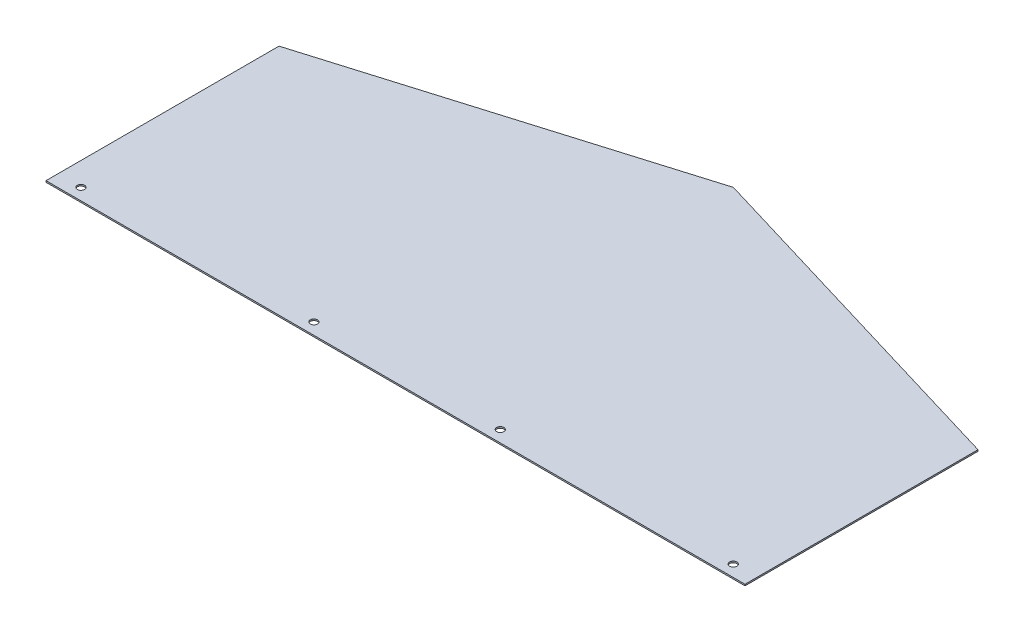
ISO-10303-21;
HEADER;
FILE_DESCRIPTION(('STEP AP214'),'2;1');
FILE_NAME('part.step','',(''),(''),'','','');
FILE_SCHEMA(('AUTOMOTIVE_DESIGN { 1 0 10303 214 1 1 1 1 }'));
ENDSEC;
DATA;
#1=APPLICATION_CONTEXT('core data for automotive mechanical design processes');
#2=APPLICATION_PROTOCOL_DEFINITION('international standard','automotive_design',2000,#1);
#3=PRODUCT_CONTEXT('',#1,'mechanical');
#4=PRODUCT('Part','Part','',(#3));
#5=PRODUCT_RELATED_PRODUCT_CATEGORY('part','',(#4));
#6=PRODUCT_DEFINITION_FORMATION('','',#4);
#7=PRODUCT_DEFINITION_CONTEXT('part definition',#1,'design');
#8=PRODUCT_DEFINITION('design','',#6,#7);
#9=PRODUCT_DEFINITION_SHAPE('','',#8);
#10=(LENGTH_UNIT() NAMED_UNIT(*) SI_UNIT(.MILLI.,.METRE.));
#11=(NAMED_UNIT(*) PLANE_ANGLE_UNIT() SI_UNIT($,.RADIAN.));
#12=(NAMED_UNIT(*) SI_UNIT($,.STERADIAN.) SOLID_ANGLE_UNIT());
#13=UNCERTAINTY_MEASURE_WITH_UNIT(LENGTH_MEASURE(1.E-05),#10,'distance_accuracy_value','');
#14=(GEOMETRIC_REPRESENTATION_CONTEXT(3) GLOBAL_UNCERTAINTY_ASSIGNED_CONTEXT((#13)) GLOBAL_UNIT_ASSIGNED_CONTEXT((#10,
#11,#12)) REPRESENTATION_CONTEXT('',''));
#15=CARTESIAN_POINT('',(0.,0.,0.));
#16=DIRECTION('',(0.,0.,1.));
#17=DIRECTION('',(1.,0.,0.));
#18=AXIS2_PLACEMENT_3D('',#15,#16,#17);
#19=CARTESIAN_POINT('',(0.,3.175,0.));
#20=DIRECTION('',(1.,0.,0.));
#21=DIRECTION('',(0.,0.,-1.));
#22=AXIS2_PLACEMENT_3D('',#19,#20,#21);
#23=PLANE('',#22);
#24=DIRECTION('',(0.,0.,1.));
#25=VECTOR('',#24,1.);
#26=CARTESIAN_POINT('',(0.,0.,0.));
#27=LINE('',#26,#25);
#28=CARTESIAN_POINT('',(-1.24424114793371E-13,0.,-508.));
#29=VERTEX_POINT('',#28);
#30=CARTESIAN_POINT('',(0.,0.,0.));
#31=VERTEX_POINT('',#30);
#32=EDGE_CURVE('E91',#29,#31,#27,.T.);
#33=ORIENTED_EDGE('',*,*,#32,.T.);
#34=DIRECTION('',(0.,-1.,0.));
#35=VECTOR('',#34,1.);
#36=CARTESIAN_POINT('',(0.,3.175,0.));
#37=LINE('',#36,#35);
#38=CARTESIAN_POINT('',(0.,3.175,0.));
#39=VERTEX_POINT('',#38);
#40=EDGE_CURVE('E11',#39,#31,#37,.T.);
#41=ORIENTED_EDGE('',*,*,#40,.F.);
#42=DIRECTION('',(0.,0.,1.));
#43=VECTOR('',#42,1.);
#44=CARTESIAN_POINT('',(0.,3.175,0.));
#45=LINE('',#44,#43);
#46=CARTESIAN_POINT('',(-1.24424114793371E-13,3.175,-508.));
#47=VERTEX_POINT('',#46);
#48=EDGE_CURVE('E100',#47,#39,#45,.T.);
#49=ORIENTED_EDGE('',*,*,#48,.F.);
#50=DIRECTION('',(0.,-1.,0.));
#51=VECTOR('',#50,1.);
#52=CARTESIAN_POINT('',(-1.24424114793371E-13,3.175,-508.));
#53=LINE('',#52,#51);
#54=EDGE_CURVE('E87',#47,#29,#53,.T.);
#55=ORIENTED_EDGE('',*,*,#54,.T.);
#56=EDGE_LOOP('',(#33,#41,#49,#55));
#57=FACE_BOUND('',#56,.T.);
#58=ADVANCED_FACE('F17',(#57),#23,.F.);
#59=CARTESIAN_POINT('',(0.,3.175,0.));
#60=DIRECTION('',(0.,0.,-1.));
#61=DIRECTION('',(-1.,0.,0.));
#62=AXIS2_PLACEMENT_3D('',#59,#60,#61);
#63=PLANE('',#62);
#64=DIRECTION('',(1.,0.,0.));
#65=VECTOR('',#64,1.);
#66=CARTESIAN_POINT('',(0.,0.,0.));
#67=LINE('',#66,#65);
#68=CARTESIAN_POINT('',(1524.,0.,0.));
#69=VERTEX_POINT('',#68);
#70=EDGE_CURVE('E94',#31,#69,#67,.T.);
#71=ORIENTED_EDGE('',*,*,#70,.T.);
#72=DIRECTION('',(0.,-1.,0.));
#73=VECTOR('',#72,1.);
#74=CARTESIAN_POINT('',(1524.,3.175,0.));
#75=LINE('',#74,#73);
#76=CARTESIAN_POINT('',(1524.,3.175,0.));
#77=VERTEX_POINT('',#76);
#78=EDGE_CURVE('E25',#77,#69,#75,.T.);
#79=ORIENTED_EDGE('',*,*,#78,.F.);
#80=DIRECTION('',(1.,0.,0.));
#81=VECTOR('',#80,1.);
#82=CARTESIAN_POINT('',(0.,3.175,0.));
#83=LINE('',#82,#81);
#84=EDGE_CURVE('E67',#39,#77,#83,.T.);
#85=ORIENTED_EDGE('',*,*,#84,.F.);
#86=ORIENTED_EDGE('',*,*,#40,.T.);
#87=EDGE_LOOP('',(#71,#79,#85,#86));
#88=FACE_BOUND('',#87,.T.);
#89=ADVANCED_FACE('F122',(#88),#63,.F.);
#90=CARTESIAN_POINT('',(1524.,3.175,0.));
#91=DIRECTION('',(-1.,0.,0.));
#92=DIRECTION('',(0.,0.,1.));
#93=AXIS2_PLACEMENT_3D('',#90,#91,#92);
#94=PLANE('',#93);
#95=DIRECTION('',(0.,0.,-1.));
#96=VECTOR('',#95,1.);
#97=CARTESIAN_POINT('',(1524.,0.,0.));
#98=LINE('',#97,#96);
#99=CARTESIAN_POINT('',(1524.,0.,-508.));
#100=VERTEX_POINT('',#99);
#101=EDGE_CURVE('E82',#69,#100,#98,.T.);
#102=ORIENTED_EDGE('',*,*,#101,.T.);
#103=DIRECTION('',(0.,-1.,0.));
#104=VECTOR('',#103,1.);
#105=CARTESIAN_POINT('',(1524.,3.175,-508.));
#106=LINE('',#105,#104);
#107=CARTESIAN_POINT('',(1524.,3.175,-508.));
#108=VERTEX_POINT('',#107);
#109=EDGE_CURVE('E79',#108,#100,#106,.T.);
#110=ORIENTED_EDGE('',*,*,#109,.F.);
#111=DIRECTION('',(0.,0.,-1.));
#112=VECTOR('',#111,1.);
#113=CARTESIAN_POINT('',(1524.,3.175,0.));
#114=LINE('',#113,#112);
#115=EDGE_CURVE('E71',#77,#108,#114,.T.);
#116=ORIENTED_EDGE('',*,*,#115,.F.);
#117=ORIENTED_EDGE('',*,*,#78,.T.);
#118=EDGE_LOOP('',(#102,#110,#116,#117));
#119=FACE_BOUND('',#118,.T.);
#120=ADVANCED_FACE('F80',(#119),#94,.F.);
#121=CARTESIAN_POINT('',(762.,3.175,-736.6));
#122=DIRECTION('',(-0.287347885566346,0.,0.957826285221151));
#123=DIRECTION('',(0.957826285221152,0.,0.287347885566346));
#124=AXIS2_PLACEMENT_3D('',#121,#122,#123);
#125=PLANE('',#124);
#126=DIRECTION('',(-0.957826285221151,0.,-0.287347885566346));
#127=VECTOR('',#126,1.);
#128=CARTESIAN_POINT('',(762.,0.,-736.6));
#129=LINE('',#128,#127);
#130=CARTESIAN_POINT('',(762.,0.,-736.6));
#131=VERTEX_POINT('',#130);
#132=EDGE_CURVE('E53',#100,#131,#129,.T.);
#133=ORIENTED_EDGE('',*,*,#132,.T.);
#134=DIRECTION('',(0.,-1.,0.));
#135=VECTOR('',#134,1.);
#136=CARTESIAN_POINT('',(762.,3.175,-736.6));
#137=LINE('',#136,#135);
#138=CARTESIAN_POINT('',(762.,3.175,-736.6));
#139=VERTEX_POINT('',#138);
#140=EDGE_CURVE('E83',#139,#131,#137,.T.);
#141=ORIENTED_EDGE('',*,*,#140,.F.);
#142=DIRECTION('',(-0.957826285221151,0.,-0.287347885566346));
#143=VECTOR('',#142,1.);
#144=CARTESIAN_POINT('',(762.,3.175,-736.6));
#145=LINE('',#144,#143);
#146=EDGE_CURVE('E75',#108,#139,#145,.T.);
#147=ORIENTED_EDGE('',*,*,#146,.F.);
#148=ORIENTED_EDGE('',*,*,#109,.T.);
#149=EDGE_LOOP('',(#133,#141,#147,#148));
#150=FACE_BOUND('',#149,.T.);
#151=ADVANCED_FACE('F85',(#150),#125,.F.);
#152=CARTESIAN_POINT('',(-1.24424114793371E-13,3.175,-508.));
#153=DIRECTION('',(0.287347885566346,0.,0.957826285221151));
#154=DIRECTION('',(0.957826285221152,0.,-0.287347885566346));
#155=AXIS2_PLACEMENT_3D('',#152,#153,#154);
#156=PLANE('',#155);
#157=DIRECTION('',(-0.957826285221151,0.,0.287347885566346));
#158=VECTOR('',#157,1.);
#159=CARTESIAN_POINT('',(-1.24424114793371E-13,0.,-508.));
#160=LINE('',#159,#158);
#161=EDGE_CURVE('E59',#131,#29,#160,.T.);
#162=ORIENTED_EDGE('',*,*,#161,.T.);
#163=ORIENTED_EDGE('',*,*,#54,.F.);
#164=DIRECTION('',(-0.957826285221151,0.,0.287347885566346));
#165=VECTOR('',#164,1.);
#166=CARTESIAN_POINT('',(-1.24424114793371E-13,3.175,-508.));
#167=LINE('',#166,#165);
#168=EDGE_CURVE('E33',#139,#47,#167,.T.);
#169=ORIENTED_EDGE('',*,*,#168,.F.);
#170=ORIENTED_EDGE('',*,*,#140,.T.);
#171=EDGE_LOOP('',(#162,#163,#169,#170));
#172=FACE_BOUND('',#171,.T.);
#173=ADVANCED_FACE('F108',(#172),#156,.F.);
#174=CARTESIAN_POINT('',(0.,3.175,0.));
#175=DIRECTION('',(0.,-1.,0.));
#176=DIRECTION('',(0.,0.,-1.));
#177=AXIS2_PLACEMENT_3D('',#174,#175,#176);
#178=PLANE('',#177);
#179=CARTESIAN_POINT('',(50.8,3.175,-25.4));
#180=DIRECTION('',(0.,-1.,0.));
#181=DIRECTION('',(0.,0.,-1.));
#182=AXIS2_PLACEMENT_3D('',#179,#180,#181);
#183=CIRCLE('',#182,7.9375);
#184=CARTESIAN_POINT('',(50.8,3.175,-33.3375));
#185=VERTEX_POINT('',#184);
#186=EDGE_CURVE('E211',#185,#185,#183,.T.);
#187=ORIENTED_EDGE('',*,*,#186,.T.);
#188=EDGE_LOOP('',(#187));
#189=FACE_BOUND('',#188,.T.);
#190=CARTESIAN_POINT('',(558.8,3.175,-25.3259602988576));
#191=DIRECTION('',(0.,-1.,0.));
#192=DIRECTION('',(0.,0.,-1.));
#193=AXIS2_PLACEMENT_3D('',#190,#191,#192);
#194=CIRCLE('',#193,7.9375);
#195=CARTESIAN_POINT('',(558.8,3.175,-33.2634602988576));
#196=VERTEX_POINT('',#195);
#197=EDGE_CURVE('E221',#196,#196,#194,.T.);
#198=ORIENTED_EDGE('',*,*,#197,.T.);
#199=EDGE_LOOP('',(#198));
#200=FACE_BOUND('',#199,.T.);
#201=CARTESIAN_POINT('',(965.2,3.175,-25.2667285379436));
#202=DIRECTION('',(0.,-1.,0.));
#203=DIRECTION('',(0.,0.,-1.));
#204=AXIS2_PLACEMENT_3D('',#201,#202,#203);
#205=CIRCLE('',#204,7.9375);
#206=CARTESIAN_POINT('',(965.2,3.175,-33.2042285379436));
#207=VERTEX_POINT('',#206);
#208=EDGE_CURVE('E227',#207,#207,#205,.T.);
#209=ORIENTED_EDGE('',*,*,#208,.T.);
#210=EDGE_LOOP('',(#209));
#211=FACE_BOUND('',#210,.T.);
#212=CARTESIAN_POINT('',(1473.2,3.175,-25.1926888368012));
#213=DIRECTION('',(0.,-1.,0.));
#214=DIRECTION('',(0.,0.,-1.));
#215=AXIS2_PLACEMENT_3D('',#212,#213,#214);
#216=CIRCLE('',#215,7.9375);
#217=CARTESIAN_POINT('',(1473.2,3.175,-33.1301888368012));
#218=VERTEX_POINT('',#217);
#219=EDGE_CURVE('E95',#218,#218,#216,.T.);
#220=ORIENTED_EDGE('',*,*,#219,.T.);
#221=EDGE_LOOP('',(#220));
#222=FACE_BOUND('',#221,.T.);
#223=ORIENTED_EDGE('',*,*,#48,.T.);
#224=ORIENTED_EDGE('',*,*,#84,.T.);
#225=ORIENTED_EDGE('',*,*,#115,.T.);
#226=ORIENTED_EDGE('',*,*,#146,.T.);
#227=ORIENTED_EDGE('',*,*,#168,.T.);
#228=EDGE_LOOP('',(#223,#224,#225,#226,#227));
#229=FACE_BOUND('',#228,.T.);
#230=ADVANCED_FACE('F73',(#189,#200,#211,#222,#229),#178,.F.);
#231=CARTESIAN_POINT('',(0.,0.,0.));
#232=DIRECTION('',(0.,-1.,0.));
#233=DIRECTION('',(0.,0.,-1.));
#234=AXIS2_PLACEMENT_3D('',#231,#232,#233);
#235=PLANE('',#234);
#236=CARTESIAN_POINT('',(50.8,0.,-25.4));
#237=DIRECTION('',(0.,-1.,0.));
#238=DIRECTION('',(0.,0.,-1.));
#239=AXIS2_PLACEMENT_3D('',#236,#237,#238);
#240=CIRCLE('',#239,7.9375);
#241=CARTESIAN_POINT('',(50.8,0.,-33.3375));
#242=VERTEX_POINT('',#241);
#243=EDGE_CURVE('E214',#242,#242,#240,.T.);
#244=ORIENTED_EDGE('',*,*,#243,.F.);
#245=EDGE_LOOP('',(#244));
#246=FACE_BOUND('',#245,.T.);
#247=CARTESIAN_POINT('',(558.8,0.,-25.3259602988576));
#248=DIRECTION('',(0.,-1.,0.));
#249=DIRECTION('',(0.,0.,-1.));
#250=AXIS2_PLACEMENT_3D('',#247,#248,#249);
#251=CIRCLE('',#250,7.9375);
#252=CARTESIAN_POINT('',(558.8,0.,-33.2634602988576));
#253=VERTEX_POINT('',#252);
#254=EDGE_CURVE('E216',#253,#253,#251,.T.);
#255=ORIENTED_EDGE('',*,*,#254,.F.);
#256=EDGE_LOOP('',(#255));
#257=FACE_BOUND('',#256,.T.);
#258=CARTESIAN_POINT('',(965.2,0.,-25.2667285379436));
#259=DIRECTION('',(0.,-1.,0.));
#260=DIRECTION('',(0.,0.,-1.));
#261=AXIS2_PLACEMENT_3D('',#258,#259,#260);
#262=CIRCLE('',#261,7.9375);
#263=CARTESIAN_POINT('',(965.2,0.,-33.2042285379436));
#264=VERTEX_POINT('',#263);
#265=EDGE_CURVE('E224',#264,#264,#262,.T.);
#266=ORIENTED_EDGE('',*,*,#265,.F.);
#267=EDGE_LOOP('',(#266));
#268=FACE_BOUND('',#267,.T.);
#269=CARTESIAN_POINT('',(1473.2,0.,-25.1926888368012));
#270=DIRECTION('',(0.,-1.,0.));
#271=DIRECTION('',(0.,0.,-1.));
#272=AXIS2_PLACEMENT_3D('',#269,#270,#271);
#273=CIRCLE('',#272,7.9375);
#274=CARTESIAN_POINT('',(1473.2,0.,-33.1301888368012));
#275=VERTEX_POINT('',#274);
#276=EDGE_CURVE('E230',#275,#275,#273,.T.);
#277=ORIENTED_EDGE('',*,*,#276,.F.);
#278=EDGE_LOOP('',(#277));
#279=FACE_BOUND('',#278,.T.);
#280=ORIENTED_EDGE('',*,*,#32,.F.);
#281=ORIENTED_EDGE('',*,*,#161,.F.);
#282=ORIENTED_EDGE('',*,*,#132,.F.);
#283=ORIENTED_EDGE('',*,*,#101,.F.);
#284=ORIENTED_EDGE('',*,*,#70,.F.);
#285=EDGE_LOOP('',(#280,#281,#282,#283,#284));
#286=FACE_BOUND('',#285,.T.);
#287=ADVANCED_FACE('F104',(#246,#257,#268,#279,#286),#235,.T.);
#288=CARTESIAN_POINT('',(1473.2,0.,-25.1926888368012));
#289=DIRECTION('',(0.,-1.,0.));
#290=DIRECTION('',(0.,0.,-1.));
#291=AXIS2_PLACEMENT_3D('',#288,#289,#290);
#292=CYLINDRICAL_SURFACE('',#291,7.9375);
#293=ORIENTED_EDGE('',*,*,#219,.F.);
#294=EDGE_LOOP('',(#293));
#295=FACE_BOUND('',#294,.T.);
#296=ORIENTED_EDGE('',*,*,#276,.T.);
#297=EDGE_LOOP('',(#296));
#298=FACE_BOUND('',#297,.T.);
#299=ADVANCED_FACE('F163',(#295,#298),#292,.F.);
#300=CARTESIAN_POINT('',(965.2,0.,-25.2667285379436));
#301=DIRECTION('',(0.,-1.,0.));
#302=DIRECTION('',(0.,0.,-1.));
#303=AXIS2_PLACEMENT_3D('',#300,#301,#302);
#304=CYLINDRICAL_SURFACE('',#303,7.9375);
#305=ORIENTED_EDGE('',*,*,#208,.F.);
#306=EDGE_LOOP('',(#305));
#307=FACE_BOUND('',#306,.T.);
#308=ORIENTED_EDGE('',*,*,#265,.T.);
#309=EDGE_LOOP('',(#308));
#310=FACE_BOUND('',#309,.T.);
#311=ADVANCED_FACE('F172',(#307,#310),#304,.F.);
#312=CARTESIAN_POINT('',(558.8,0.,-25.3259602988576));
#313=DIRECTION('',(0.,-1.,0.));
#314=DIRECTION('',(0.,0.,-1.));
#315=AXIS2_PLACEMENT_3D('',#312,#313,#314);
#316=CYLINDRICAL_SURFACE('',#315,7.9375);
#317=ORIENTED_EDGE('',*,*,#197,.F.);
#318=EDGE_LOOP('',(#317));
#319=FACE_BOUND('',#318,.T.);
#320=ORIENTED_EDGE('',*,*,#254,.T.);
#321=EDGE_LOOP('',(#320));
#322=FACE_BOUND('',#321,.T.);
#323=ADVANCED_FACE('F182',(#319,#322),#316,.F.);
#324=CARTESIAN_POINT('',(50.8,0.,-25.4));
#325=DIRECTION('',(0.,-1.,0.));
#326=DIRECTION('',(0.,0.,-1.));
#327=AXIS2_PLACEMENT_3D('',#324,#325,#326);
#328=CYLINDRICAL_SURFACE('',#327,7.9375);
#329=ORIENTED_EDGE('',*,*,#186,.F.);
#330=EDGE_LOOP('',(#329));
#331=FACE_BOUND('',#330,.T.);
#332=ORIENTED_EDGE('',*,*,#243,.T.);
#333=EDGE_LOOP('',(#332));
#334=FACE_BOUND('',#333,.T.);
#335=ADVANCED_FACE('F192',(#331,#334),#328,.F.);
#336=CLOSED_SHELL('',(#58,#89,#120,#151,#173,#230,#287,#299,#311,#323,#335));
#337=MANIFOLD_SOLID_BREP('B1',#336);
#338=ADVANCED_BREP_SHAPE_REPRESENTATION('',(#18,#337),#14);
#339=SHAPE_DEFINITION_REPRESENTATION(#9,#338);
ENDSEC;
END-ISO-10303-21;
